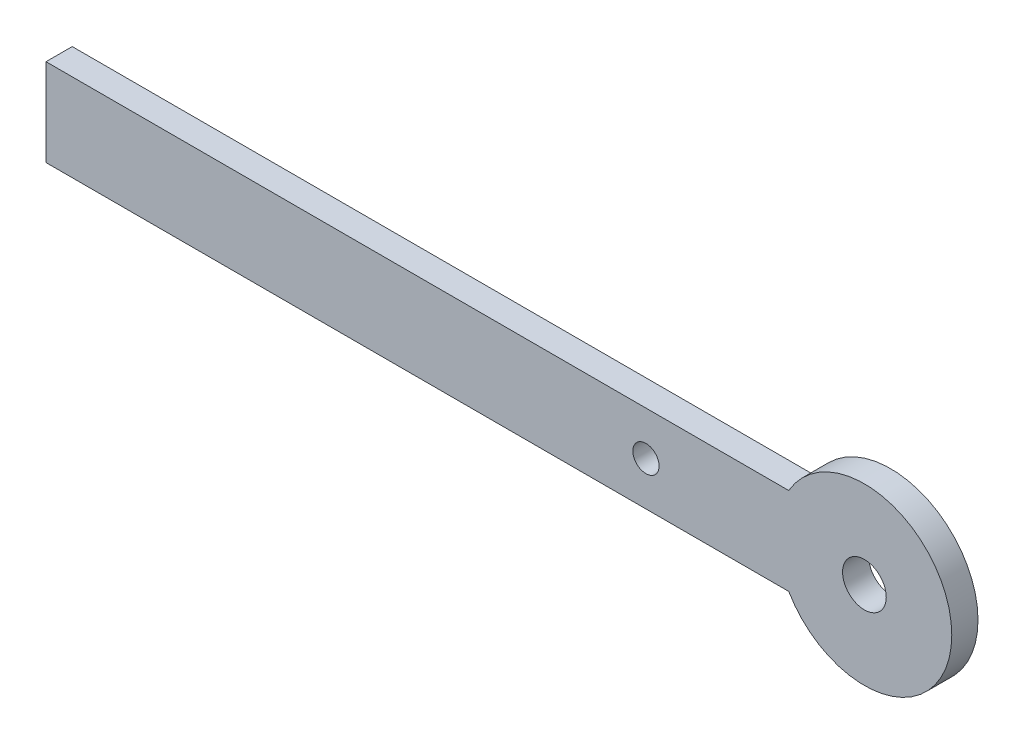
ISO-10303-21;
HEADER;
FILE_DESCRIPTION(('STEP AP214'),'2;1');
FILE_NAME('part.step','',(''),(''),'','','');
FILE_SCHEMA(('AUTOMOTIVE_DESIGN { 1 0 10303 214 1 1 1 1 }'));
ENDSEC;
DATA;
#1=APPLICATION_CONTEXT('core data for automotive mechanical design processes');
#2=APPLICATION_PROTOCOL_DEFINITION('international standard','automotive_design',2000,#1);
#3=PRODUCT_CONTEXT('',#1,'mechanical');
#4=PRODUCT('Part','Part','',(#3));
#5=PRODUCT_RELATED_PRODUCT_CATEGORY('part','',(#4));
#6=PRODUCT_DEFINITION_FORMATION('','',#4);
#7=PRODUCT_DEFINITION_CONTEXT('part definition',#1,'design');
#8=PRODUCT_DEFINITION('design','',#6,#7);
#9=PRODUCT_DEFINITION_SHAPE('','',#8);
#10=(LENGTH_UNIT() NAMED_UNIT(*) SI_UNIT(.MILLI.,.METRE.));
#11=(NAMED_UNIT(*) PLANE_ANGLE_UNIT() SI_UNIT($,.RADIAN.));
#12=(NAMED_UNIT(*) SI_UNIT($,.STERADIAN.) SOLID_ANGLE_UNIT());
#13=UNCERTAINTY_MEASURE_WITH_UNIT(LENGTH_MEASURE(1.E-05),#10,'distance_accuracy_value','');
#14=(GEOMETRIC_REPRESENTATION_CONTEXT(3) GLOBAL_UNCERTAINTY_ASSIGNED_CONTEXT((#13)) GLOBAL_UNIT_ASSIGNED_CONTEXT((#10,
#11,#12)) REPRESENTATION_CONTEXT('',''));
#15=CARTESIAN_POINT('',(0.,0.,0.));
#16=DIRECTION('',(0.,0.,1.));
#17=DIRECTION('',(1.,0.,0.));
#18=AXIS2_PLACEMENT_3D('',#15,#16,#17);
#19=CARTESIAN_POINT('',(0.,0.,3.));
#20=DIRECTION('',(0.,0.,1.));
#21=DIRECTION('',(1.,0.,0.));
#22=AXIS2_PLACEMENT_3D('',#19,#20,#21);
#23=PLANE('',#22);
#24=CARTESIAN_POINT('',(-25.,0.,3.));
#25=DIRECTION('',(0.,0.,1.));
#26=DIRECTION('',(1.,0.,0.));
#27=AXIS2_PLACEMENT_3D('',#24,#25,#26);
#28=CIRCLE('',#27,1.50000000000001);
#29=CARTESIAN_POINT('',(-23.5,0.,3.));
#30=VERTEX_POINT('',#29);
#31=EDGE_CURVE('E114',#30,#30,#28,.T.);
#32=ORIENTED_EDGE('',*,*,#31,.F.);
#33=EDGE_LOOP('',(#32));
#34=FACE_BOUND('',#33,.T.);
#35=DIRECTION('',(0.,-1.,0.));
#36=VECTOR('',#35,1.);
#37=CARTESIAN_POINT('',(-93.6602540378444,4.99999999999999,3.));
#38=LINE('',#37,#36);
#39=CARTESIAN_POINT('',(-93.6602540378444,4.99999999999999,3.));
#40=VERTEX_POINT('',#39);
#41=CARTESIAN_POINT('',(-93.6602540378444,-5.00000000000001,3.));
#42=VERTEX_POINT('',#41);
#43=EDGE_CURVE('E84',#40,#42,#38,.T.);
#44=ORIENTED_EDGE('',*,*,#43,.T.);
#45=DIRECTION('',(1.,0.,0.));
#46=VECTOR('',#45,1.);
#47=CARTESIAN_POINT('',(-93.6602540378444,-5.00000000000001,3.));
#48=LINE('',#47,#46);
#49=CARTESIAN_POINT('',(-8.66025403784438,-5.,3.));
#50=VERTEX_POINT('',#49);
#51=EDGE_CURVE('E79',#42,#50,#48,.T.);
#52=ORIENTED_EDGE('',*,*,#51,.T.);
#53=CARTESIAN_POINT('',(0.,0.,3.));
#54=DIRECTION('',(0.,0.,1.));
#55=DIRECTION('',(1.,0.,0.));
#56=AXIS2_PLACEMENT_3D('',#53,#54,#55);
#57=CIRCLE('',#56,10.);
#58=CARTESIAN_POINT('',(-8.66025403784439,4.99999999999999,3.));
#59=VERTEX_POINT('',#58);
#60=EDGE_CURVE('E82',#50,#59,#57,.T.);
#61=ORIENTED_EDGE('',*,*,#60,.T.);
#62=DIRECTION('',(-1.,0.,0.));
#63=VECTOR('',#62,1.);
#64=CARTESIAN_POINT('',(-93.6602540378444,4.99999999999999,3.));
#65=LINE('',#64,#63);
#66=EDGE_CURVE('E49',#59,#40,#65,.T.);
#67=ORIENTED_EDGE('',*,*,#66,.T.);
#68=EDGE_LOOP('',(#44,#52,#61,#67));
#69=FACE_BOUND('',#68,.T.);
#70=CARTESIAN_POINT('',(0.,0.,3.));
#71=DIRECTION('',(0.,0.,1.));
#72=DIRECTION('',(1.,0.,0.));
#73=AXIS2_PLACEMENT_3D('',#70,#71,#72);
#74=CIRCLE('',#73,2.5);
#75=CARTESIAN_POINT('',(2.5,0.,3.));
#76=VERTEX_POINT('',#75);
#77=EDGE_CURVE('E99',#76,#76,#74,.T.);
#78=ORIENTED_EDGE('',*,*,#77,.F.);
#79=EDGE_LOOP('',(#78));
#80=FACE_BOUND('',#79,.T.);
#81=ADVANCED_FACE('F32',(#34,#69,#80),#23,.T.);
#82=CARTESIAN_POINT('',(0.,0.,0.));
#83=DIRECTION('',(0.,0.,1.));
#84=DIRECTION('',(1.,0.,0.));
#85=AXIS2_PLACEMENT_3D('',#82,#83,#84);
#86=PLANE('',#85);
#87=CARTESIAN_POINT('',(-25.,0.,0.));
#88=DIRECTION('',(0.,0.,-1.));
#89=DIRECTION('',(-1.,0.,0.));
#90=AXIS2_PLACEMENT_3D('',#87,#88,#89);
#91=CIRCLE('',#90,1.50000000000001);
#92=CARTESIAN_POINT('',(-26.5,0.,0.));
#93=VERTEX_POINT('',#92);
#94=EDGE_CURVE('E119',#93,#93,#91,.T.);
#95=ORIENTED_EDGE('',*,*,#94,.F.);
#96=EDGE_LOOP('',(#95));
#97=FACE_BOUND('',#96,.T.);
#98=DIRECTION('',(0.,-1.,0.));
#99=VECTOR('',#98,1.);
#100=CARTESIAN_POINT('',(-93.6602540378444,4.99999999999999,0.));
#101=LINE('',#100,#99);
#102=CARTESIAN_POINT('',(-93.6602540378444,4.99999999999999,0.));
#103=VERTEX_POINT('',#102);
#104=CARTESIAN_POINT('',(-93.6602540378444,-5.00000000000001,0.));
#105=VERTEX_POINT('',#104);
#106=EDGE_CURVE('E96',#103,#105,#101,.T.);
#107=ORIENTED_EDGE('',*,*,#106,.F.);
#108=DIRECTION('',(-1.,0.,0.));
#109=VECTOR('',#108,1.);
#110=CARTESIAN_POINT('',(-93.6602540378444,4.99999999999999,0.));
#111=LINE('',#110,#109);
#112=CARTESIAN_POINT('',(-8.66025403784439,4.99999999999999,0.));
#113=VERTEX_POINT('',#112);
#114=EDGE_CURVE('E72',#113,#103,#111,.T.);
#115=ORIENTED_EDGE('',*,*,#114,.F.);
#116=CARTESIAN_POINT('',(0.,0.,0.));
#117=DIRECTION('',(0.,0.,1.));
#118=DIRECTION('',(1.,0.,0.));
#119=AXIS2_PLACEMENT_3D('',#116,#117,#118);
#120=CIRCLE('',#119,10.);
#121=CARTESIAN_POINT('',(-8.66025403784438,-5.,0.));
#122=VERTEX_POINT('',#121);
#123=EDGE_CURVE('E66',#122,#113,#120,.T.);
#124=ORIENTED_EDGE('',*,*,#123,.F.);
#125=DIRECTION('',(1.,0.,0.));
#126=VECTOR('',#125,1.);
#127=CARTESIAN_POINT('',(-93.6602540378444,-5.00000000000001,0.));
#128=LINE('',#127,#126);
#129=EDGE_CURVE('E88',#105,#122,#128,.T.);
#130=ORIENTED_EDGE('',*,*,#129,.F.);
#131=EDGE_LOOP('',(#107,#115,#124,#130));
#132=FACE_BOUND('',#131,.T.);
#133=CARTESIAN_POINT('',(0.,0.,0.));
#134=DIRECTION('',(0.,0.,1.));
#135=DIRECTION('',(1.,0.,0.));
#136=AXIS2_PLACEMENT_3D('',#133,#134,#135);
#137=CIRCLE('',#136,2.5);
#138=CARTESIAN_POINT('',(2.5,0.,0.));
#139=VERTEX_POINT('',#138);
#140=EDGE_CURVE('E111',#139,#139,#137,.T.);
#141=ORIENTED_EDGE('',*,*,#140,.T.);
#142=EDGE_LOOP('',(#141));
#143=FACE_BOUND('',#142,.T.);
#144=ADVANCED_FACE('F107',(#97,#132,#143),#86,.F.);
#145=CARTESIAN_POINT('',(-93.6602540378444,4.99999999999999,3.));
#146=DIRECTION('',(1.,0.,0.));
#147=DIRECTION('',(0.,0.,-1.));
#148=AXIS2_PLACEMENT_3D('',#145,#146,#147);
#149=PLANE('',#148);
#150=ORIENTED_EDGE('',*,*,#106,.T.);
#151=DIRECTION('',(0.,0.,-1.));
#152=VECTOR('',#151,1.);
#153=CARTESIAN_POINT('',(-93.6602540378444,-5.00000000000001,3.));
#154=LINE('',#153,#152);
#155=EDGE_CURVE('E11',#42,#105,#154,.T.);
#156=ORIENTED_EDGE('',*,*,#155,.F.);
#157=ORIENTED_EDGE('',*,*,#43,.F.);
#158=DIRECTION('',(0.,0.,-1.));
#159=VECTOR('',#158,1.);
#160=CARTESIAN_POINT('',(-93.6602540378444,4.99999999999999,3.));
#161=LINE('',#160,#159);
#162=EDGE_CURVE('E92',#40,#103,#161,.T.);
#163=ORIENTED_EDGE('',*,*,#162,.T.);
#164=EDGE_LOOP('',(#150,#156,#157,#163));
#165=FACE_BOUND('',#164,.T.);
#166=ADVANCED_FACE('F34',(#165),#149,.F.);
#167=CARTESIAN_POINT('',(-93.6602540378444,-5.00000000000001,3.));
#168=DIRECTION('',(0.,1.,0.));
#169=DIRECTION('',(-1.,0.,0.));
#170=AXIS2_PLACEMENT_3D('',#167,#168,#169);
#171=PLANE('',#170);
#172=ORIENTED_EDGE('',*,*,#129,.T.);
#173=DIRECTION('',(0.,0.,-1.));
#174=VECTOR('',#173,1.);
#175=CARTESIAN_POINT('',(-8.66025403784438,-5.,3.));
#176=LINE('',#175,#174);
#177=EDGE_CURVE('E41',#50,#122,#176,.T.);
#178=ORIENTED_EDGE('',*,*,#177,.F.);
#179=ORIENTED_EDGE('',*,*,#51,.F.);
#180=ORIENTED_EDGE('',*,*,#155,.T.);
#181=EDGE_LOOP('',(#172,#178,#179,#180));
#182=FACE_BOUND('',#181,.T.);
#183=ADVANCED_FACE('F87',(#182),#171,.F.);
#184=CARTESIAN_POINT('',(0.,0.,3.));
#185=DIRECTION('',(0.,0.,-1.));
#186=DIRECTION('',(-1.,0.,0.));
#187=AXIS2_PLACEMENT_3D('',#184,#185,#186);
#188=CYLINDRICAL_SURFACE('',#187,10.);
#189=ORIENTED_EDGE('',*,*,#123,.T.);
#190=DIRECTION('',(0.,0.,-1.));
#191=VECTOR('',#190,1.);
#192=CARTESIAN_POINT('',(-8.66025403784439,4.99999999999999,3.));
#193=LINE('',#192,#191);
#194=EDGE_CURVE('E89',#59,#113,#193,.T.);
#195=ORIENTED_EDGE('',*,*,#194,.F.);
#196=ORIENTED_EDGE('',*,*,#60,.F.);
#197=ORIENTED_EDGE('',*,*,#177,.T.);
#198=EDGE_LOOP('',(#189,#195,#196,#197));
#199=FACE_BOUND('',#198,.T.);
#200=ADVANCED_FACE('F90',(#199),#188,.T.);
#201=CARTESIAN_POINT('',(-93.6602540378444,4.99999999999999,3.));
#202=DIRECTION('',(0.,-1.,0.));
#203=DIRECTION('',(1.,0.,0.));
#204=AXIS2_PLACEMENT_3D('',#201,#202,#203);
#205=PLANE('',#204);
#206=ORIENTED_EDGE('',*,*,#114,.T.);
#207=ORIENTED_EDGE('',*,*,#162,.F.);
#208=ORIENTED_EDGE('',*,*,#66,.F.);
#209=ORIENTED_EDGE('',*,*,#194,.T.);
#210=EDGE_LOOP('',(#206,#207,#208,#209));
#211=FACE_BOUND('',#210,.T.);
#212=ADVANCED_FACE('F104',(#211),#205,.F.);
#213=CARTESIAN_POINT('',(0.,0.,3.));
#214=DIRECTION('',(0.,0.,-1.));
#215=DIRECTION('',(-1.,0.,0.));
#216=AXIS2_PLACEMENT_3D('',#213,#214,#215);
#217=CYLINDRICAL_SURFACE('',#216,2.5);
#218=ORIENTED_EDGE('',*,*,#77,.T.);
#219=EDGE_LOOP('',(#218));
#220=FACE_BOUND('',#219,.T.);
#221=ORIENTED_EDGE('',*,*,#140,.F.);
#222=EDGE_LOOP('',(#221));
#223=FACE_BOUND('',#222,.T.);
#224=ADVANCED_FACE('F137',(#220,#223),#217,.F.);
#225=CARTESIAN_POINT('',(-25.,0.,10.));
#226=DIRECTION('',(0.,0.,-1.));
#227=DIRECTION('',(-1.,0.,0.));
#228=AXIS2_PLACEMENT_3D('',#225,#226,#227);
#229=CYLINDRICAL_SURFACE('',#228,1.50000000000001);
#230=ORIENTED_EDGE('',*,*,#31,.T.);
#231=EDGE_LOOP('',(#230));
#232=FACE_BOUND('',#231,.T.);
#233=ORIENTED_EDGE('',*,*,#94,.T.);
#234=EDGE_LOOP('',(#233));
#235=FACE_BOUND('',#234,.T.);
#236=ADVANCED_FACE('F123',(#232,#235),#229,.F.);
#237=CLOSED_SHELL('',(#81,#144,#166,#183,#200,#212,#224,#236));
#238=MANIFOLD_SOLID_BREP('B2',#237);
#239=ADVANCED_BREP_SHAPE_REPRESENTATION('',(#18,#238),#14);
#240=SHAPE_DEFINITION_REPRESENTATION(#9,#239);
ENDSEC;
END-ISO-10303-21;
